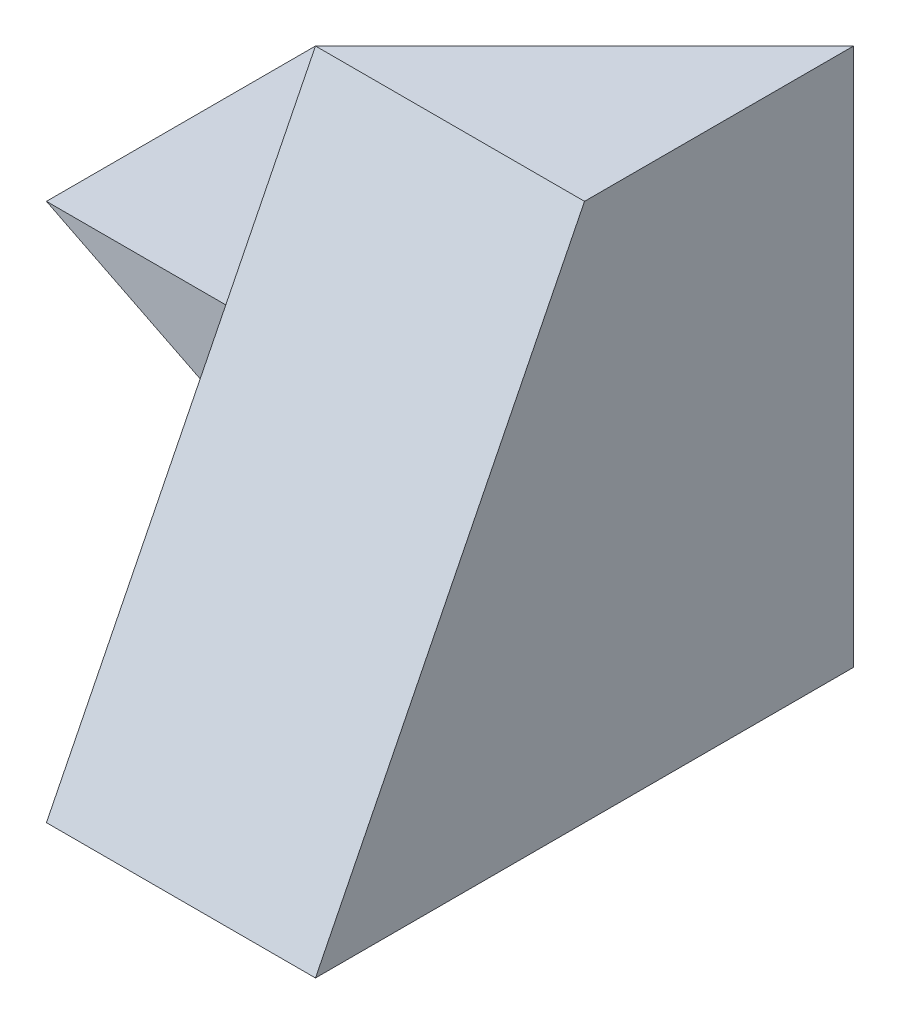
ISO-10303-21;
HEADER;
FILE_DESCRIPTION(('STEP AP214'),'2;1');
FILE_NAME('part.step','',(''),(''),'','','');
FILE_SCHEMA(('AUTOMOTIVE_DESIGN { 1 0 10303 214 1 1 1 1 }'));
ENDSEC;
DATA;
#1=APPLICATION_CONTEXT('core data for automotive mechanical design processes');
#2=APPLICATION_PROTOCOL_DEFINITION('international standard','automotive_design',2000,#1);
#3=PRODUCT_CONTEXT('',#1,'mechanical');
#4=PRODUCT('Part','Part','',(#3));
#5=PRODUCT_RELATED_PRODUCT_CATEGORY('part','',(#4));
#6=PRODUCT_DEFINITION_FORMATION('','',#4);
#7=PRODUCT_DEFINITION_CONTEXT('part definition',#1,'design');
#8=PRODUCT_DEFINITION('design','',#6,#7);
#9=PRODUCT_DEFINITION_SHAPE('','',#8);
#10=(LENGTH_UNIT() NAMED_UNIT(*) SI_UNIT(.MILLI.,.METRE.));
#11=(NAMED_UNIT(*) PLANE_ANGLE_UNIT() SI_UNIT($,.RADIAN.));
#12=(NAMED_UNIT(*) SI_UNIT($,.STERADIAN.) SOLID_ANGLE_UNIT());
#13=UNCERTAINTY_MEASURE_WITH_UNIT(LENGTH_MEASURE(1.E-05),#10,'distance_accuracy_value','');
#14=(GEOMETRIC_REPRESENTATION_CONTEXT(3) GLOBAL_UNCERTAINTY_ASSIGNED_CONTEXT((#13)) GLOBAL_UNIT_ASSIGNED_CONTEXT((#10,
#11,#12)) REPRESENTATION_CONTEXT('',''));
#15=CARTESIAN_POINT('',(0.,0.,0.));
#16=DIRECTION('',(0.,0.,1.));
#17=DIRECTION('',(1.,0.,0.));
#18=AXIS2_PLACEMENT_3D('',#15,#16,#17);
#19=CARTESIAN_POINT('',(0.,0.,40.));
#20=DIRECTION('',(0.,1.,0.));
#21=DIRECTION('',(0.,0.,1.));
#22=AXIS2_PLACEMENT_3D('',#19,#20,#21);
#23=PLANE('',#22);
#24=DIRECTION('',(-1.,0.,0.));
#25=VECTOR('',#24,1.);
#26=CARTESIAN_POINT('',(0.,0.,20.));
#27=LINE('',#26,#25);
#28=CARTESIAN_POINT('',(40.,0.,20.));
#29=VERTEX_POINT('',#28);
#30=CARTESIAN_POINT('',(20.,0.,20.));
#31=VERTEX_POINT('',#30);
#32=EDGE_CURVE('E148',#29,#31,#27,.T.);
#33=ORIENTED_EDGE('',*,*,#32,.F.);
#34=DIRECTION('',(0.,0.,-1.));
#35=VECTOR('',#34,1.);
#36=CARTESIAN_POINT('',(40.,0.,40.));
#37=LINE('',#36,#35);
#38=CARTESIAN_POINT('',(40.,0.,40.));
#39=VERTEX_POINT('',#38);
#40=EDGE_CURVE('E40',#39,#29,#37,.T.);
#41=ORIENTED_EDGE('',*,*,#40,.F.);
#42=DIRECTION('',(1.,0.,0.));
#43=VECTOR('',#42,1.);
#44=CARTESIAN_POINT('',(0.,0.,40.));
#45=LINE('',#44,#43);
#46=CARTESIAN_POINT('',(20.,0.,40.));
#47=VERTEX_POINT('',#46);
#48=EDGE_CURVE('E132',#47,#39,#45,.T.);
#49=ORIENTED_EDGE('',*,*,#48,.F.);
#50=DIRECTION('',(0.,0.,1.));
#51=VECTOR('',#50,1.);
#52=CARTESIAN_POINT('',(20.,0.,0.));
#53=LINE('',#52,#51);
#54=EDGE_CURVE('E54',#31,#47,#53,.T.);
#55=ORIENTED_EDGE('',*,*,#54,.F.);
#56=EDGE_LOOP('',(#33,#41,#49,#55));
#57=FACE_BOUND('',#56,.T.);
#58=ADVANCED_FACE('F33',(#57),#23,.F.);
#59=CARTESIAN_POINT('',(20.,40.,0.));
#60=DIRECTION('',(1.,0.,0.));
#61=DIRECTION('',(0.,1.,0.));
#62=AXIS2_PLACEMENT_3D('',#59,#60,#61);
#63=PLANE('',#62);
#64=DIRECTION('',(0.,0.894427190999916,-0.447213595499958));
#65=VECTOR('',#64,1.);
#66=CARTESIAN_POINT('',(20.,16.,32.));
#67=LINE('',#66,#65);
#68=CARTESIAN_POINT('',(20.,40.,20.));
#69=VERTEX_POINT('',#68);
#70=EDGE_CURVE('E11',#47,#69,#67,.T.);
#71=ORIENTED_EDGE('',*,*,#70,.T.);
#72=DIRECTION('',(0.,1.,0.));
#73=VECTOR('',#72,1.);
#74=CARTESIAN_POINT('',(20.,20.,20.));
#75=LINE('',#74,#73);
#76=CARTESIAN_POINT('',(20.,20.,20.));
#77=VERTEX_POINT('',#76);
#78=EDGE_CURVE('E93',#77,#69,#75,.T.);
#79=ORIENTED_EDGE('',*,*,#78,.F.);
#80=DIRECTION('',(0.,-1.,0.));
#81=VECTOR('',#80,1.);
#82=CARTESIAN_POINT('',(20.,40.,20.));
#83=LINE('',#82,#81);
#84=CARTESIAN_POINT('',(20.,10.,20.));
#85=VERTEX_POINT('',#84);
#86=EDGE_CURVE('E106',#77,#85,#83,.T.);
#87=ORIENTED_EDGE('',*,*,#86,.T.);
#88=DIRECTION('',(0.,1.,0.));
#89=VECTOR('',#88,1.);
#90=CARTESIAN_POINT('',(20.,0.,20.));
#91=LINE('',#90,#89);
#92=EDGE_CURVE('E154',#31,#85,#91,.T.);
#93=ORIENTED_EDGE('',*,*,#92,.F.);
#94=ORIENTED_EDGE('',*,*,#54,.T.);
#95=EDGE_LOOP('',(#71,#79,#87,#93,#94));
#96=FACE_BOUND('',#95,.T.);
#97=ADVANCED_FACE('F105',(#96),#63,.F.);
#98=CARTESIAN_POINT('',(40.,0.,40.));
#99=DIRECTION('',(-1.,0.,0.));
#100=DIRECTION('',(0.,0.,1.));
#101=AXIS2_PLACEMENT_3D('',#98,#99,#100);
#102=PLANE('',#101);
#103=DIRECTION('',(0.,0.,-1.));
#104=VECTOR('',#103,1.);
#105=CARTESIAN_POINT('',(40.,40.,40.));
#106=LINE('',#105,#104);
#107=CARTESIAN_POINT('',(40.,40.,20.));
#108=VERTEX_POINT('',#107);
#109=CARTESIAN_POINT('',(40.,40.,0.));
#110=VERTEX_POINT('',#109);
#111=EDGE_CURVE('E134',#108,#110,#106,.T.);
#112=ORIENTED_EDGE('',*,*,#111,.F.);
#113=DIRECTION('',(0.,0.894427190999916,-0.447213595499958));
#114=VECTOR('',#113,1.);
#115=CARTESIAN_POINT('',(40.,0.,40.));
#116=LINE('',#115,#114);
#117=EDGE_CURVE('E117',#39,#108,#116,.T.);
#118=ORIENTED_EDGE('',*,*,#117,.F.);
#119=ORIENTED_EDGE('',*,*,#40,.T.);
#120=DIRECTION('',(0.,0.,-1.));
#121=VECTOR('',#120,1.);
#122=CARTESIAN_POINT('',(40.,0.,20.));
#123=LINE('',#122,#121);
#124=CARTESIAN_POINT('',(40.,0.,0.));
#125=VERTEX_POINT('',#124);
#126=EDGE_CURVE('E114',#29,#125,#123,.T.);
#127=ORIENTED_EDGE('',*,*,#126,.T.);
#128=DIRECTION('',(0.,1.,0.));
#129=VECTOR('',#128,1.);
#130=CARTESIAN_POINT('',(40.,0.,0.));
#131=LINE('',#130,#129);
#132=CARTESIAN_POINT('',(40.,20.,0.));
#133=VERTEX_POINT('',#132);
#134=EDGE_CURVE('E131',#125,#133,#131,.T.);
#135=ORIENTED_EDGE('',*,*,#134,.T.);
#136=DIRECTION('',(0.,1.,0.));
#137=VECTOR('',#136,1.);
#138=CARTESIAN_POINT('',(40.,20.,0.));
#139=LINE('',#138,#137);
#140=EDGE_CURVE('E96',#133,#110,#139,.T.);
#141=ORIENTED_EDGE('',*,*,#140,.T.);
#142=EDGE_LOOP('',(#112,#118,#119,#127,#135,#141));
#143=FACE_BOUND('',#142,.T.);
#144=ADVANCED_FACE('F143',(#143),#102,.F.);
#145=CARTESIAN_POINT('',(0.,40.,40.));
#146=DIRECTION('',(0.,-1.,0.));
#147=DIRECTION('',(0.,0.,-1.));
#148=AXIS2_PLACEMENT_3D('',#145,#146,#147);
#149=PLANE('',#148);
#150=ORIENTED_EDGE('',*,*,#111,.T.);
#151=DIRECTION('',(0.707106781186547,0.,-0.707106781186548));
#152=VECTOR('',#151,1.);
#153=CARTESIAN_POINT('',(20.,40.,20.));
#154=LINE('',#153,#152);
#155=EDGE_CURVE('E101',#69,#110,#154,.T.);
#156=ORIENTED_EDGE('',*,*,#155,.F.);
#157=DIRECTION('',(1.,0.,0.));
#158=VECTOR('',#157,1.);
#159=CARTESIAN_POINT('',(0.,40.,20.));
#160=LINE('',#159,#158);
#161=EDGE_CURVE('E119',#69,#108,#160,.T.);
#162=ORIENTED_EDGE('',*,*,#161,.T.);
#163=EDGE_LOOP('',(#150,#156,#162));
#164=FACE_BOUND('',#163,.T.);
#165=ADVANCED_FACE('F160',(#164),#149,.F.);
#166=CARTESIAN_POINT('',(0.,0.,0.));
#167=DIRECTION('',(0.,0.,-1.));
#168=DIRECTION('',(-1.,0.,0.));
#169=AXIS2_PLACEMENT_3D('',#166,#167,#168);
#170=PLANE('',#169);
#171=DIRECTION('',(1.,0.,0.));
#172=VECTOR('',#171,1.);
#173=CARTESIAN_POINT('',(0.,20.,0.));
#174=LINE('',#173,#172);
#175=CARTESIAN_POINT('',(0.,20.,0.));
#176=VERTEX_POINT('',#175);
#177=EDGE_CURVE('E128',#176,#133,#174,.T.);
#178=ORIENTED_EDGE('',*,*,#177,.T.);
#179=ORIENTED_EDGE('',*,*,#134,.F.);
#180=DIRECTION('',(-0.894427190999916,0.447213595499958,0.));
#181=VECTOR('',#180,1.);
#182=CARTESIAN_POINT('',(20.,10.,0.));
#183=LINE('',#182,#181);
#184=EDGE_CURVE('E125',#125,#176,#183,.T.);
#185=ORIENTED_EDGE('',*,*,#184,.T.);
#186=EDGE_LOOP('',(#178,#179,#185));
#187=FACE_BOUND('',#186,.T.);
#188=ADVANCED_FACE('F184',(#187),#170,.T.);
#189=CARTESIAN_POINT('',(0.,20.,0.));
#190=DIRECTION('',(0.,-1.,0.));
#191=DIRECTION('',(0.,0.,-1.));
#192=AXIS2_PLACEMENT_3D('',#189,#190,#191);
#193=PLANE('',#192);
#194=DIRECTION('',(0.,0.,1.));
#195=VECTOR('',#194,1.);
#196=CARTESIAN_POINT('',(0.,20.,0.));
#197=LINE('',#196,#195);
#198=CARTESIAN_POINT('',(0.,20.,20.));
#199=VERTEX_POINT('',#198);
#200=EDGE_CURVE('E47',#176,#199,#197,.T.);
#201=ORIENTED_EDGE('',*,*,#200,.T.);
#202=DIRECTION('',(1.,0.,0.));
#203=VECTOR('',#202,1.);
#204=CARTESIAN_POINT('',(0.,20.,20.));
#205=LINE('',#204,#203);
#206=EDGE_CURVE('E112',#199,#77,#205,.T.);
#207=ORIENTED_EDGE('',*,*,#206,.T.);
#208=DIRECTION('',(0.707106781186547,0.,-0.707106781186548));
#209=VECTOR('',#208,1.);
#210=CARTESIAN_POINT('',(20.,20.,20.));
#211=LINE('',#210,#209);
#212=EDGE_CURVE('E90',#77,#133,#211,.T.);
#213=ORIENTED_EDGE('',*,*,#212,.T.);
#214=ORIENTED_EDGE('',*,*,#177,.F.);
#215=EDGE_LOOP('',(#201,#207,#213,#214));
#216=FACE_BOUND('',#215,.T.);
#217=ADVANCED_FACE('F116',(#216),#193,.F.);
#218=CARTESIAN_POINT('',(20.,10.,0.));
#219=DIRECTION('',(0.447213595499958,0.894427190999916,0.));
#220=DIRECTION('',(-0.894427190999916,0.447213595499958,0.));
#221=AXIS2_PLACEMENT_3D('',#218,#219,#220);
#222=PLANE('',#221);
#223=ORIENTED_EDGE('',*,*,#184,.F.);
#224=ORIENTED_EDGE('',*,*,#126,.F.);
#225=DIRECTION('',(0.894427190999916,-0.447213595499958,0.));
#226=VECTOR('',#225,1.);
#227=CARTESIAN_POINT('',(8.,16.,20.));
#228=LINE('',#227,#226);
#229=EDGE_CURVE('E151',#85,#29,#228,.T.);
#230=ORIENTED_EDGE('',*,*,#229,.F.);
#231=DIRECTION('',(-0.894427190999916,0.447213595499958,0.));
#232=VECTOR('',#231,1.);
#233=CARTESIAN_POINT('',(20.,10.,20.));
#234=LINE('',#233,#232);
#235=EDGE_CURVE('E113',#85,#199,#234,.T.);
#236=ORIENTED_EDGE('',*,*,#235,.T.);
#237=ORIENTED_EDGE('',*,*,#200,.F.);
#238=EDGE_LOOP('',(#223,#224,#230,#236,#237));
#239=FACE_BOUND('',#238,.T.);
#240=ADVANCED_FACE('F164',(#239),#222,.F.);
#241=CARTESIAN_POINT('',(0.,0.,40.));
#242=DIRECTION('',(0.,-0.447213595499958,-0.894427190999916));
#243=DIRECTION('',(0.,0.894427190999916,-0.447213595499958));
#244=AXIS2_PLACEMENT_3D('',#241,#242,#243);
#245=PLANE('',#244);
#246=ORIENTED_EDGE('',*,*,#161,.F.);
#247=ORIENTED_EDGE('',*,*,#70,.F.);
#248=ORIENTED_EDGE('',*,*,#48,.T.);
#249=ORIENTED_EDGE('',*,*,#117,.T.);
#250=EDGE_LOOP('',(#246,#247,#248,#249));
#251=FACE_BOUND('',#250,.T.);
#252=ADVANCED_FACE('F162',(#251),#245,.F.);
#253=CARTESIAN_POINT('',(20.,40.,20.));
#254=DIRECTION('',(0.,0.,-1.));
#255=DIRECTION('',(-1.,0.,0.));
#256=AXIS2_PLACEMENT_3D('',#253,#254,#255);
#257=PLANE('',#256);
#258=ORIENTED_EDGE('',*,*,#235,.F.);
#259=ORIENTED_EDGE('',*,*,#86,.F.);
#260=ORIENTED_EDGE('',*,*,#206,.F.);
#261=EDGE_LOOP('',(#258,#259,#260));
#262=FACE_BOUND('',#261,.T.);
#263=ADVANCED_FACE('F111',(#262),#257,.F.);
#264=CARTESIAN_POINT('',(0.,0.,20.));
#265=DIRECTION('',(0.,0.,-1.));
#266=DIRECTION('',(-1.,0.,0.));
#267=AXIS2_PLACEMENT_3D('',#264,#265,#266);
#268=PLANE('',#267);
#269=ORIENTED_EDGE('',*,*,#92,.T.);
#270=ORIENTED_EDGE('',*,*,#229,.T.);
#271=ORIENTED_EDGE('',*,*,#32,.T.);
#272=EDGE_LOOP('',(#269,#270,#271));
#273=FACE_BOUND('',#272,.T.);
#274=ADVANCED_FACE('F170',(#273),#268,.T.);
#275=CARTESIAN_POINT('',(20.,20.,20.));
#276=DIRECTION('',(0.707106781186548,0.,0.707106781186547));
#277=DIRECTION('',(0.707106781186547,0.,-0.707106781186548));
#278=AXIS2_PLACEMENT_3D('',#275,#276,#277);
#279=PLANE('',#278);
#280=ORIENTED_EDGE('',*,*,#155,.T.);
#281=ORIENTED_EDGE('',*,*,#140,.F.);
#282=ORIENTED_EDGE('',*,*,#212,.F.);
#283=ORIENTED_EDGE('',*,*,#78,.T.);
#284=EDGE_LOOP('',(#280,#281,#282,#283));
#285=FACE_BOUND('',#284,.T.);
#286=ADVANCED_FACE('F92',(#285),#279,.F.);
#287=CLOSED_SHELL('',(#58,#97,#144,#165,#188,#217,#240,#252,#263,#274,#286));
#288=MANIFOLD_SOLID_BREP('B2',#287);
#289=ADVANCED_BREP_SHAPE_REPRESENTATION('',(#18,#288),#14);
#290=SHAPE_DEFINITION_REPRESENTATION(#9,#289);
ENDSEC;
END-ISO-10303-21;
